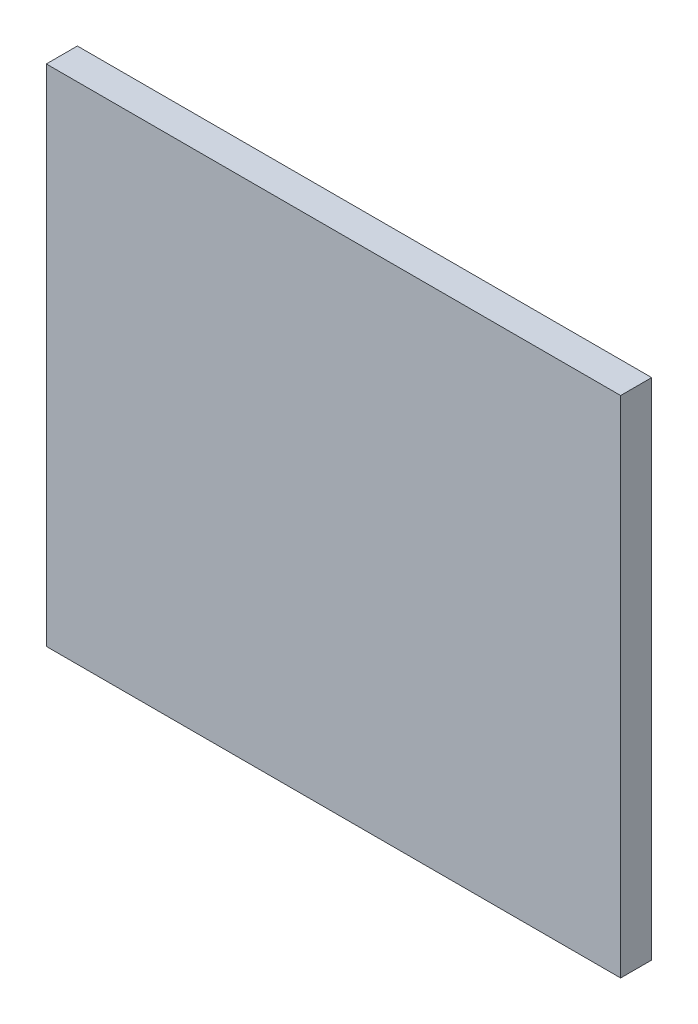
ISO-10303-21;
HEADER;
FILE_DESCRIPTION(('STEP AP214'),'2;1');
FILE_NAME('part.step','',(''),(''),'','','');
FILE_SCHEMA(('AUTOMOTIVE_DESIGN { 1 0 10303 214 1 1 1 1 }'));
ENDSEC;
DATA;
#1=APPLICATION_CONTEXT('core data for automotive mechanical design processes');
#2=APPLICATION_PROTOCOL_DEFINITION('international standard','automotive_design',2000,#1);
#3=PRODUCT_CONTEXT('',#1,'mechanical');
#4=PRODUCT('Part','Part','',(#3));
#5=PRODUCT_RELATED_PRODUCT_CATEGORY('part','',(#4));
#6=PRODUCT_DEFINITION_FORMATION('','',#4);
#7=PRODUCT_DEFINITION_CONTEXT('part definition',#1,'design');
#8=PRODUCT_DEFINITION('design','',#6,#7);
#9=PRODUCT_DEFINITION_SHAPE('','',#8);
#10=(LENGTH_UNIT() NAMED_UNIT(*) SI_UNIT(.MILLI.,.METRE.));
#11=(NAMED_UNIT(*) PLANE_ANGLE_UNIT() SI_UNIT($,.RADIAN.));
#12=(NAMED_UNIT(*) SI_UNIT($,.STERADIAN.) SOLID_ANGLE_UNIT());
#13=UNCERTAINTY_MEASURE_WITH_UNIT(LENGTH_MEASURE(1.E-05),#10,'distance_accuracy_value','');
#14=(GEOMETRIC_REPRESENTATION_CONTEXT(3) GLOBAL_UNCERTAINTY_ASSIGNED_CONTEXT((#13)) GLOBAL_UNIT_ASSIGNED_CONTEXT((#10,
#11,#12)) REPRESENTATION_CONTEXT('',''));
#15=CARTESIAN_POINT('',(0.,0.,0.));
#16=DIRECTION('',(0.,0.,1.));
#17=DIRECTION('',(1.,0.,0.));
#18=AXIS2_PLACEMENT_3D('',#15,#16,#17);
#19=CARTESIAN_POINT('',(37.,-32.5,4.));
#20=DIRECTION('',(-1.,0.,0.));
#21=DIRECTION('',(0.,0.,1.));
#22=AXIS2_PLACEMENT_3D('',#19,#20,#21);
#23=PLANE('',#22);
#24=DIRECTION('',(0.,1.,0.));
#25=VECTOR('',#24,1.);
#26=CARTESIAN_POINT('',(37.,-32.5,0.));
#27=LINE('',#26,#25);
#28=CARTESIAN_POINT('',(37.,-32.5,0.));
#29=VERTEX_POINT('',#28);
#30=CARTESIAN_POINT('',(37.,32.5,0.));
#31=VERTEX_POINT('',#30);
#32=EDGE_CURVE('E97',#29,#31,#27,.T.);
#33=ORIENTED_EDGE('',*,*,#32,.T.);
#34=DIRECTION('',(0.,0.,-1.));
#35=VECTOR('',#34,1.);
#36=CARTESIAN_POINT('',(37.,32.5,4.));
#37=LINE('',#36,#35);
#38=CARTESIAN_POINT('',(37.,32.5,4.));
#39=VERTEX_POINT('',#38);
#40=EDGE_CURVE('E11',#39,#31,#37,.T.);
#41=ORIENTED_EDGE('',*,*,#40,.F.);
#42=DIRECTION('',(0.,1.,0.));
#43=VECTOR('',#42,1.);
#44=CARTESIAN_POINT('',(37.,-32.5,4.));
#45=LINE('',#44,#43);
#46=CARTESIAN_POINT('',(37.,-32.5,4.));
#47=VERTEX_POINT('',#46);
#48=EDGE_CURVE('E85',#47,#39,#45,.T.);
#49=ORIENTED_EDGE('',*,*,#48,.F.);
#50=DIRECTION('',(0.,0.,-1.));
#51=VECTOR('',#50,1.);
#52=CARTESIAN_POINT('',(37.,-32.5,4.));
#53=LINE('',#52,#51);
#54=EDGE_CURVE('E93',#47,#29,#53,.T.);
#55=ORIENTED_EDGE('',*,*,#54,.T.);
#56=EDGE_LOOP('',(#33,#41,#49,#55));
#57=FACE_BOUND('',#56,.T.);
#58=ADVANCED_FACE('F34',(#57),#23,.F.);
#59=CARTESIAN_POINT('',(-37.,32.5,4.));
#60=DIRECTION('',(0.,-1.,0.));
#61=DIRECTION('',(0.,0.,-1.));
#62=AXIS2_PLACEMENT_3D('',#59,#60,#61);
#63=PLANE('',#62);
#64=DIRECTION('',(-1.,0.,0.));
#65=VECTOR('',#64,1.);
#66=CARTESIAN_POINT('',(-37.,32.5,0.));
#67=LINE('',#66,#65);
#68=CARTESIAN_POINT('',(-37.,32.5,0.));
#69=VERTEX_POINT('',#68);
#70=EDGE_CURVE('E89',#31,#69,#67,.T.);
#71=ORIENTED_EDGE('',*,*,#70,.T.);
#72=DIRECTION('',(0.,0.,-1.));
#73=VECTOR('',#72,1.);
#74=CARTESIAN_POINT('',(-37.,32.5,4.));
#75=LINE('',#74,#73);
#76=CARTESIAN_POINT('',(-37.,32.5,4.));
#77=VERTEX_POINT('',#76);
#78=EDGE_CURVE('E42',#77,#69,#75,.T.);
#79=ORIENTED_EDGE('',*,*,#78,.F.);
#80=DIRECTION('',(-1.,0.,0.));
#81=VECTOR('',#80,1.);
#82=CARTESIAN_POINT('',(-37.,32.5,4.));
#83=LINE('',#82,#81);
#84=EDGE_CURVE('E80',#39,#77,#83,.T.);
#85=ORIENTED_EDGE('',*,*,#84,.F.);
#86=ORIENTED_EDGE('',*,*,#40,.T.);
#87=EDGE_LOOP('',(#71,#79,#85,#86));
#88=FACE_BOUND('',#87,.T.);
#89=ADVANCED_FACE('F88',(#88),#63,.F.);
#90=CARTESIAN_POINT('',(-37.,-32.5,4.));
#91=DIRECTION('',(1.,0.,0.));
#92=DIRECTION('',(0.,0.,-1.));
#93=AXIS2_PLACEMENT_3D('',#90,#91,#92);
#94=PLANE('',#93);
#95=DIRECTION('',(0.,-1.,0.));
#96=VECTOR('',#95,1.);
#97=CARTESIAN_POINT('',(-37.,-32.5,0.));
#98=LINE('',#97,#96);
#99=CARTESIAN_POINT('',(-37.,-32.5,0.));
#100=VERTEX_POINT('',#99);
#101=EDGE_CURVE('E67',#69,#100,#98,.T.);
#102=ORIENTED_EDGE('',*,*,#101,.T.);
#103=DIRECTION('',(0.,0.,-1.));
#104=VECTOR('',#103,1.);
#105=CARTESIAN_POINT('',(-37.,-32.5,4.));
#106=LINE('',#105,#104);
#107=CARTESIAN_POINT('',(-37.,-32.5,4.));
#108=VERTEX_POINT('',#107);
#109=EDGE_CURVE('E90',#108,#100,#106,.T.);
#110=ORIENTED_EDGE('',*,*,#109,.F.);
#111=DIRECTION('',(0.,-1.,0.));
#112=VECTOR('',#111,1.);
#113=CARTESIAN_POINT('',(-37.,-32.5,4.));
#114=LINE('',#113,#112);
#115=EDGE_CURVE('E83',#77,#108,#114,.T.);
#116=ORIENTED_EDGE('',*,*,#115,.F.);
#117=ORIENTED_EDGE('',*,*,#78,.T.);
#118=EDGE_LOOP('',(#102,#110,#116,#117));
#119=FACE_BOUND('',#118,.T.);
#120=ADVANCED_FACE('F91',(#119),#94,.F.);
#121=CARTESIAN_POINT('',(-37.,-32.5,4.));
#122=DIRECTION('',(0.,1.,0.));
#123=DIRECTION('',(0.,0.,1.));
#124=AXIS2_PLACEMENT_3D('',#121,#122,#123);
#125=PLANE('',#124);
#126=DIRECTION('',(1.,0.,0.));
#127=VECTOR('',#126,1.);
#128=CARTESIAN_POINT('',(-37.,-32.5,0.));
#129=LINE('',#128,#127);
#130=EDGE_CURVE('E73',#100,#29,#129,.T.);
#131=ORIENTED_EDGE('',*,*,#130,.T.);
#132=ORIENTED_EDGE('',*,*,#54,.F.);
#133=DIRECTION('',(1.,0.,0.));
#134=VECTOR('',#133,1.);
#135=CARTESIAN_POINT('',(-37.,-32.5,4.));
#136=LINE('',#135,#134);
#137=EDGE_CURVE('E50',#108,#47,#136,.T.);
#138=ORIENTED_EDGE('',*,*,#137,.F.);
#139=ORIENTED_EDGE('',*,*,#109,.T.);
#140=EDGE_LOOP('',(#131,#132,#138,#139));
#141=FACE_BOUND('',#140,.T.);
#142=ADVANCED_FACE('F104',(#141),#125,.F.);
#143=CARTESIAN_POINT('',(0.,0.,4.));
#144=DIRECTION('',(0.,0.,-1.));
#145=DIRECTION('',(-1.,0.,0.));
#146=AXIS2_PLACEMENT_3D('',#143,#144,#145);
#147=PLANE('',#146);
#148=ORIENTED_EDGE('',*,*,#48,.T.);
#149=ORIENTED_EDGE('',*,*,#84,.T.);
#150=ORIENTED_EDGE('',*,*,#115,.T.);
#151=ORIENTED_EDGE('',*,*,#137,.T.);
#152=EDGE_LOOP('',(#148,#149,#150,#151));
#153=FACE_BOUND('',#152,.T.);
#154=ADVANCED_FACE('F81',(#153),#147,.F.);
#155=CARTESIAN_POINT('',(0.,0.,0.));
#156=DIRECTION('',(0.,0.,-1.));
#157=DIRECTION('',(-1.,0.,0.));
#158=AXIS2_PLACEMENT_3D('',#155,#156,#157);
#159=PLANE('',#158);
#160=ORIENTED_EDGE('',*,*,#32,.F.);
#161=ORIENTED_EDGE('',*,*,#130,.F.);
#162=ORIENTED_EDGE('',*,*,#101,.F.);
#163=ORIENTED_EDGE('',*,*,#70,.F.);
#164=EDGE_LOOP('',(#160,#161,#162,#163));
#165=FACE_BOUND('',#164,.T.);
#166=ADVANCED_FACE('F107',(#165),#159,.T.);
#167=CLOSED_SHELL('',(#58,#89,#120,#142,#154,#166));
#168=MANIFOLD_SOLID_BREP('B2',#167);
#169=ADVANCED_BREP_SHAPE_REPRESENTATION('',(#18,#168),#14);
#170=SHAPE_DEFINITION_REPRESENTATION(#9,#169);
ENDSEC;
END-ISO-10303-21;
